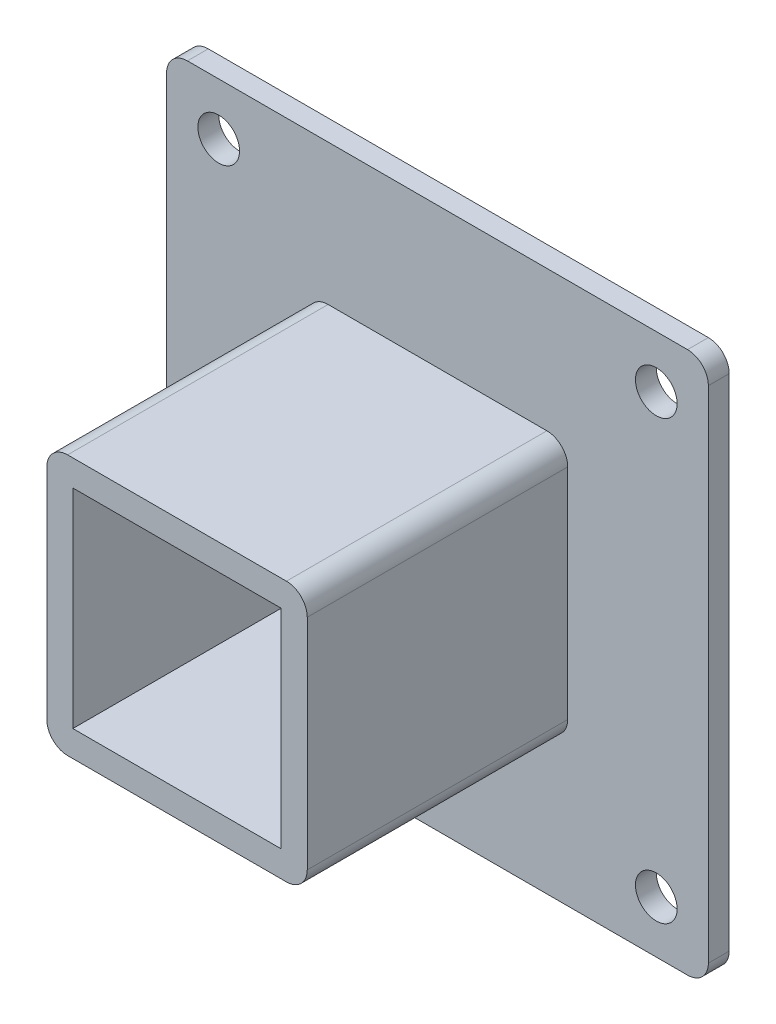
ISO-10303-21;
HEADER;
FILE_DESCRIPTION(('STEP AP214'),'2;1');
FILE_NAME('part.step','',(''),(''),'','','');
FILE_SCHEMA(('AUTOMOTIVE_DESIGN { 1 0 10303 214 1 1 1 1 }'));
ENDSEC;
DATA;
#1=APPLICATION_CONTEXT('core data for automotive mechanical design processes');
#2=APPLICATION_PROTOCOL_DEFINITION('international standard','automotive_design',2000,#1);
#3=PRODUCT_CONTEXT('',#1,'mechanical');
#4=PRODUCT('Part','Part','',(#3));
#5=PRODUCT_RELATED_PRODUCT_CATEGORY('part','',(#4));
#6=PRODUCT_DEFINITION_FORMATION('','',#4);
#7=PRODUCT_DEFINITION_CONTEXT('part definition',#1,'design');
#8=PRODUCT_DEFINITION('design','',#6,#7);
#9=PRODUCT_DEFINITION_SHAPE('','',#8);
#10=(LENGTH_UNIT() NAMED_UNIT(*) SI_UNIT(.MILLI.,.METRE.));
#11=(NAMED_UNIT(*) PLANE_ANGLE_UNIT() SI_UNIT($,.RADIAN.));
#12=(NAMED_UNIT(*) SI_UNIT($,.STERADIAN.) SOLID_ANGLE_UNIT());
#13=UNCERTAINTY_MEASURE_WITH_UNIT(LENGTH_MEASURE(1.E-05),#10,'distance_accuracy_value','');
#14=(GEOMETRIC_REPRESENTATION_CONTEXT(3) GLOBAL_UNCERTAINTY_ASSIGNED_CONTEXT((#13)) GLOBAL_UNIT_ASSIGNED_CONTEXT((#10,
#11,#12)) REPRESENTATION_CONTEXT('',''));
#15=CARTESIAN_POINT('',(0.,0.,0.));
#16=DIRECTION('',(0.,0.,1.));
#17=DIRECTION('',(1.,0.,0.));
#18=AXIS2_PLACEMENT_3D('',#15,#16,#17);
#19=CARTESIAN_POINT('',(10.5,-10.5,25.));
#20=DIRECTION('',(0.,0.,-1.));
#21=DIRECTION('',(-1.,0.,0.));
#22=AXIS2_PLACEMENT_3D('',#19,#20,#21);
#23=CYLINDRICAL_SURFACE('',#22,2.);
#24=DIRECTION('',(0.,0.,-1.));
#25=VECTOR('',#24,1.);
#26=CARTESIAN_POINT('',(12.5,-10.5,25.));
#27=LINE('',#26,#25);
#28=CARTESIAN_POINT('',(12.5,-10.5,25.));
#29=VERTEX_POINT('',#28);
#30=CARTESIAN_POINT('',(12.5,-10.5,0.));
#31=VERTEX_POINT('',#30);
#32=EDGE_CURVE('E327',#29,#31,#27,.T.);
#33=ORIENTED_EDGE('',*,*,#32,.F.);
#34=CARTESIAN_POINT('',(10.5,-10.5,25.));
#35=DIRECTION('',(0.,0.,1.));
#36=DIRECTION('',(1.,0.,0.));
#37=AXIS2_PLACEMENT_3D('',#34,#35,#36);
#38=CIRCLE('',#37,2.);
#39=CARTESIAN_POINT('',(10.5,-12.5,25.));
#40=VERTEX_POINT('',#39);
#41=EDGE_CURVE('E47',#40,#29,#38,.T.);
#42=ORIENTED_EDGE('',*,*,#41,.F.);
#43=DIRECTION('',(0.,0.,-1.));
#44=VECTOR('',#43,1.);
#45=CARTESIAN_POINT('',(10.5,-12.5,25.));
#46=LINE('',#45,#44);
#47=CARTESIAN_POINT('',(10.5,-12.5,0.));
#48=VERTEX_POINT('',#47);
#49=EDGE_CURVE('E330',#48,#40,#46,.F.);
#50=ORIENTED_EDGE('',*,*,#49,.F.);
#51=CARTESIAN_POINT('',(10.5,-10.5,0.));
#52=DIRECTION('',(0.,0.,-1.));
#53=DIRECTION('',(-1.,0.,0.));
#54=AXIS2_PLACEMENT_3D('',#51,#52,#53);
#55=CIRCLE('',#54,2.);
#56=EDGE_CURVE('E11',#48,#31,#55,.F.);
#57=ORIENTED_EDGE('',*,*,#56,.T.);
#58=EDGE_LOOP('',(#33,#42,#50,#57));
#59=FACE_BOUND('',#58,.T.);
#60=ADVANCED_FACE('F39',(#59),#23,.T.);
#61=CARTESIAN_POINT('',(10.5,10.5,25.));
#62=DIRECTION('',(0.,0.,-1.));
#63=DIRECTION('',(-1.,0.,0.));
#64=AXIS2_PLACEMENT_3D('',#61,#62,#63);
#65=CYLINDRICAL_SURFACE('',#64,2.);
#66=DIRECTION('',(0.,0.,-1.));
#67=VECTOR('',#66,1.);
#68=CARTESIAN_POINT('',(10.5,12.5,25.));
#69=LINE('',#68,#67);
#70=CARTESIAN_POINT('',(10.5,12.5,25.));
#71=VERTEX_POINT('',#70);
#72=CARTESIAN_POINT('',(10.5,12.5,0.));
#73=VERTEX_POINT('',#72);
#74=EDGE_CURVE('E317',#71,#73,#69,.T.);
#75=ORIENTED_EDGE('',*,*,#74,.F.);
#76=CARTESIAN_POINT('',(10.5,10.5,25.));
#77=DIRECTION('',(0.,0.,1.));
#78=DIRECTION('',(1.,0.,0.));
#79=AXIS2_PLACEMENT_3D('',#76,#77,#78);
#80=CIRCLE('',#79,2.);
#81=CARTESIAN_POINT('',(12.5,10.5,25.));
#82=VERTEX_POINT('',#81);
#83=EDGE_CURVE('E323',#82,#71,#80,.T.);
#84=ORIENTED_EDGE('',*,*,#83,.F.);
#85=DIRECTION('',(0.,0.,-1.));
#86=VECTOR('',#85,1.);
#87=CARTESIAN_POINT('',(12.5,10.5,25.));
#88=LINE('',#87,#86);
#89=CARTESIAN_POINT('',(12.5,10.5,0.));
#90=VERTEX_POINT('',#89);
#91=EDGE_CURVE('E320',#90,#82,#88,.F.);
#92=ORIENTED_EDGE('',*,*,#91,.F.);
#93=CARTESIAN_POINT('',(10.5,10.5,0.));
#94=DIRECTION('',(0.,0.,-1.));
#95=DIRECTION('',(-1.,0.,0.));
#96=AXIS2_PLACEMENT_3D('',#93,#94,#95);
#97=CIRCLE('',#96,2.);
#98=EDGE_CURVE('E325',#90,#73,#97,.F.);
#99=ORIENTED_EDGE('',*,*,#98,.T.);
#100=EDGE_LOOP('',(#75,#84,#92,#99));
#101=FACE_BOUND('',#100,.T.);
#102=ADVANCED_FACE('F425',(#101),#65,.T.);
#103=CARTESIAN_POINT('',(-10.5,10.5,25.));
#104=DIRECTION('',(0.,0.,-1.));
#105=DIRECTION('',(-1.,0.,0.));
#106=AXIS2_PLACEMENT_3D('',#103,#104,#105);
#107=CYLINDRICAL_SURFACE('',#106,2.);
#108=DIRECTION('',(0.,0.,-1.));
#109=VECTOR('',#108,1.);
#110=CARTESIAN_POINT('',(-12.5,10.5,25.));
#111=LINE('',#110,#109);
#112=CARTESIAN_POINT('',(-12.5,10.5,25.));
#113=VERTEX_POINT('',#112);
#114=CARTESIAN_POINT('',(-12.5,10.5,0.));
#115=VERTEX_POINT('',#114);
#116=EDGE_CURVE('E307',#113,#115,#111,.T.);
#117=ORIENTED_EDGE('',*,*,#116,.F.);
#118=CARTESIAN_POINT('',(-10.5,10.5,25.));
#119=DIRECTION('',(0.,0.,1.));
#120=DIRECTION('',(1.,0.,0.));
#121=AXIS2_PLACEMENT_3D('',#118,#119,#120);
#122=CIRCLE('',#121,2.);
#123=CARTESIAN_POINT('',(-10.5,12.5,25.));
#124=VERTEX_POINT('',#123);
#125=EDGE_CURVE('E313',#124,#113,#122,.T.);
#126=ORIENTED_EDGE('',*,*,#125,.F.);
#127=DIRECTION('',(0.,0.,-1.));
#128=VECTOR('',#127,1.);
#129=CARTESIAN_POINT('',(-10.5,12.5,25.));
#130=LINE('',#129,#128);
#131=CARTESIAN_POINT('',(-10.5,12.5,0.));
#132=VERTEX_POINT('',#131);
#133=EDGE_CURVE('E310',#132,#124,#130,.F.);
#134=ORIENTED_EDGE('',*,*,#133,.F.);
#135=CARTESIAN_POINT('',(-10.5,10.5,0.));
#136=DIRECTION('',(0.,0.,-1.));
#137=DIRECTION('',(-1.,0.,0.));
#138=AXIS2_PLACEMENT_3D('',#135,#136,#137);
#139=CIRCLE('',#138,2.);
#140=EDGE_CURVE('E315',#132,#115,#139,.F.);
#141=ORIENTED_EDGE('',*,*,#140,.T.);
#142=EDGE_LOOP('',(#117,#126,#134,#141));
#143=FACE_BOUND('',#142,.T.);
#144=ADVANCED_FACE('F429',(#143),#107,.T.);
#145=CARTESIAN_POINT('',(-10.5,-10.5,25.));
#146=DIRECTION('',(0.,0.,1.));
#147=DIRECTION('',(1.,0.,0.));
#148=AXIS2_PLACEMENT_3D('',#145,#146,#147);
#149=CYLINDRICAL_SURFACE('',#148,2.);
#150=DIRECTION('',(0.,0.,1.));
#151=VECTOR('',#150,1.);
#152=CARTESIAN_POINT('',(-12.5,-10.5,25.));
#153=LINE('',#152,#151);
#154=CARTESIAN_POINT('',(-12.5,-10.5,0.));
#155=VERTEX_POINT('',#154);
#156=CARTESIAN_POINT('',(-12.5,-10.5,25.));
#157=VERTEX_POINT('',#156);
#158=EDGE_CURVE('E297',#155,#157,#153,.T.);
#159=ORIENTED_EDGE('',*,*,#158,.F.);
#160=CARTESIAN_POINT('',(-10.5,-10.5,0.));
#161=DIRECTION('',(0.,0.,-1.));
#162=DIRECTION('',(-1.,0.,0.));
#163=AXIS2_PLACEMENT_3D('',#160,#161,#162);
#164=CIRCLE('',#163,2.);
#165=CARTESIAN_POINT('',(-10.5,-12.5,0.));
#166=VERTEX_POINT('',#165);
#167=EDGE_CURVE('E305',#155,#166,#164,.F.);
#168=ORIENTED_EDGE('',*,*,#167,.T.);
#169=DIRECTION('',(0.,0.,1.));
#170=VECTOR('',#169,1.);
#171=CARTESIAN_POINT('',(-10.5,-12.5,25.));
#172=LINE('',#171,#170);
#173=CARTESIAN_POINT('',(-10.5,-12.5,25.));
#174=VERTEX_POINT('',#173);
#175=EDGE_CURVE('E300',#174,#166,#172,.F.);
#176=ORIENTED_EDGE('',*,*,#175,.F.);
#177=CARTESIAN_POINT('',(-10.5,-10.5,25.));
#178=DIRECTION('',(0.,0.,1.));
#179=DIRECTION('',(1.,0.,0.));
#180=AXIS2_PLACEMENT_3D('',#177,#178,#179);
#181=CIRCLE('',#180,2.);
#182=EDGE_CURVE('E303',#157,#174,#181,.T.);
#183=ORIENTED_EDGE('',*,*,#182,.F.);
#184=EDGE_LOOP('',(#159,#168,#176,#183));
#185=FACE_BOUND('',#184,.T.);
#186=ADVANCED_FACE('F422',(#185),#149,.T.);
#187=CARTESIAN_POINT('',(24.,24.,-2.));
#188=DIRECTION('',(0.,0.,1.));
#189=DIRECTION('',(1.,0.,0.));
#190=AXIS2_PLACEMENT_3D('',#187,#188,#189);
#191=CYLINDRICAL_SURFACE('',#190,2.);
#192=DIRECTION('',(0.,0.,1.));
#193=VECTOR('',#192,1.);
#194=CARTESIAN_POINT('',(26.,24.,-2.));
#195=LINE('',#194,#193);
#196=CARTESIAN_POINT('',(26.,24.,-2.));
#197=VERTEX_POINT('',#196);
#198=CARTESIAN_POINT('',(26.,24.,0.));
#199=VERTEX_POINT('',#198);
#200=EDGE_CURVE('E287',#197,#199,#195,.T.);
#201=ORIENTED_EDGE('',*,*,#200,.F.);
#202=CARTESIAN_POINT('',(24.,24.,-2.));
#203=DIRECTION('',(0.,0.,-1.));
#204=DIRECTION('',(-1.,0.,0.));
#205=AXIS2_PLACEMENT_3D('',#202,#203,#204);
#206=CIRCLE('',#205,2.);
#207=CARTESIAN_POINT('',(24.,26.,-2.));
#208=VERTEX_POINT('',#207);
#209=EDGE_CURVE('E293',#208,#197,#206,.T.);
#210=ORIENTED_EDGE('',*,*,#209,.F.);
#211=DIRECTION('',(0.,0.,1.));
#212=VECTOR('',#211,1.);
#213=CARTESIAN_POINT('',(24.,26.,-2.));
#214=LINE('',#213,#212);
#215=CARTESIAN_POINT('',(24.,26.,0.));
#216=VERTEX_POINT('',#215);
#217=EDGE_CURVE('E290',#216,#208,#214,.F.);
#218=ORIENTED_EDGE('',*,*,#217,.F.);
#219=CARTESIAN_POINT('',(24.,24.,0.));
#220=DIRECTION('',(0.,0.,-1.));
#221=DIRECTION('',(-1.,0.,0.));
#222=AXIS2_PLACEMENT_3D('',#219,#220,#221);
#223=CIRCLE('',#222,2.);
#224=EDGE_CURVE('E295',#199,#216,#223,.F.);
#225=ORIENTED_EDGE('',*,*,#224,.F.);
#226=EDGE_LOOP('',(#201,#210,#218,#225));
#227=FACE_BOUND('',#226,.T.);
#228=ADVANCED_FACE('F391',(#227),#191,.T.);
#229=CARTESIAN_POINT('',(24.,-24.,-2.));
#230=DIRECTION('',(0.,0.,1.));
#231=DIRECTION('',(1.,0.,0.));
#232=AXIS2_PLACEMENT_3D('',#229,#230,#231);
#233=CYLINDRICAL_SURFACE('',#232,2.);
#234=DIRECTION('',(0.,0.,1.));
#235=VECTOR('',#234,1.);
#236=CARTESIAN_POINT('',(24.,-26.,-2.));
#237=LINE('',#236,#235);
#238=CARTESIAN_POINT('',(24.,-26.,-2.));
#239=VERTEX_POINT('',#238);
#240=CARTESIAN_POINT('',(24.,-26.,0.));
#241=VERTEX_POINT('',#240);
#242=EDGE_CURVE('E276',#239,#241,#237,.T.);
#243=ORIENTED_EDGE('',*,*,#242,.F.);
#244=CARTESIAN_POINT('',(24.,-24.,-2.));
#245=DIRECTION('',(0.,0.,-1.));
#246=DIRECTION('',(-1.,0.,0.));
#247=AXIS2_PLACEMENT_3D('',#244,#245,#246);
#248=CIRCLE('',#247,2.);
#249=CARTESIAN_POINT('',(26.,-24.,-2.));
#250=VERTEX_POINT('',#249);
#251=EDGE_CURVE('E282',#250,#239,#248,.T.);
#252=ORIENTED_EDGE('',*,*,#251,.F.);
#253=DIRECTION('',(0.,0.,1.));
#254=VECTOR('',#253,1.);
#255=CARTESIAN_POINT('',(26.,-24.,-2.));
#256=LINE('',#255,#254);
#257=CARTESIAN_POINT('',(26.,-24.,0.));
#258=VERTEX_POINT('',#257);
#259=EDGE_CURVE('E279',#258,#250,#256,.F.);
#260=ORIENTED_EDGE('',*,*,#259,.F.);
#261=CARTESIAN_POINT('',(24.,-24.,0.));
#262=DIRECTION('',(0.,0.,-1.));
#263=DIRECTION('',(-1.,0.,0.));
#264=AXIS2_PLACEMENT_3D('',#261,#262,#263);
#265=CIRCLE('',#264,2.);
#266=EDGE_CURVE('E284',#241,#258,#265,.F.);
#267=ORIENTED_EDGE('',*,*,#266,.F.);
#268=EDGE_LOOP('',(#243,#252,#260,#267));
#269=FACE_BOUND('',#268,.T.);
#270=ADVANCED_FACE('F414',(#269),#233,.T.);
#271=CARTESIAN_POINT('',(-24.,-24.,-2.));
#272=DIRECTION('',(0.,0.,1.));
#273=DIRECTION('',(1.,0.,0.));
#274=AXIS2_PLACEMENT_3D('',#271,#272,#273);
#275=CYLINDRICAL_SURFACE('',#274,2.);
#276=DIRECTION('',(0.,0.,1.));
#277=VECTOR('',#276,1.);
#278=CARTESIAN_POINT('',(-26.,-24.,-2.));
#279=LINE('',#278,#277);
#280=CARTESIAN_POINT('',(-26.,-24.,-2.));
#281=VERTEX_POINT('',#280);
#282=CARTESIAN_POINT('',(-26.,-24.,0.));
#283=VERTEX_POINT('',#282);
#284=EDGE_CURVE('E265',#281,#283,#279,.T.);
#285=ORIENTED_EDGE('',*,*,#284,.F.);
#286=CARTESIAN_POINT('',(-24.,-24.,-2.));
#287=DIRECTION('',(0.,0.,-1.));
#288=DIRECTION('',(-1.,0.,0.));
#289=AXIS2_PLACEMENT_3D('',#286,#287,#288);
#290=CIRCLE('',#289,2.);
#291=CARTESIAN_POINT('',(-24.,-26.,-2.));
#292=VERTEX_POINT('',#291);
#293=EDGE_CURVE('E271',#292,#281,#290,.T.);
#294=ORIENTED_EDGE('',*,*,#293,.F.);
#295=DIRECTION('',(0.,0.,1.));
#296=VECTOR('',#295,1.);
#297=CARTESIAN_POINT('',(-24.,-26.,-2.));
#298=LINE('',#297,#296);
#299=CARTESIAN_POINT('',(-24.,-26.,0.));
#300=VERTEX_POINT('',#299);
#301=EDGE_CURVE('E268',#300,#292,#298,.F.);
#302=ORIENTED_EDGE('',*,*,#301,.F.);
#303=CARTESIAN_POINT('',(-24.,-24.,0.));
#304=DIRECTION('',(0.,0.,-1.));
#305=DIRECTION('',(-1.,0.,0.));
#306=AXIS2_PLACEMENT_3D('',#303,#304,#305);
#307=CIRCLE('',#306,2.);
#308=EDGE_CURVE('E273',#283,#300,#307,.F.);
#309=ORIENTED_EDGE('',*,*,#308,.F.);
#310=EDGE_LOOP('',(#285,#294,#302,#309));
#311=FACE_BOUND('',#310,.T.);
#312=ADVANCED_FACE('F407',(#311),#275,.T.);
#313=CARTESIAN_POINT('',(-24.,24.,-2.));
#314=DIRECTION('',(0.,0.,1.));
#315=DIRECTION('',(1.,0.,0.));
#316=AXIS2_PLACEMENT_3D('',#313,#314,#315);
#317=CYLINDRICAL_SURFACE('',#316,2.);
#318=DIRECTION('',(0.,0.,1.));
#319=VECTOR('',#318,1.);
#320=CARTESIAN_POINT('',(-24.,26.,-2.));
#321=LINE('',#320,#319);
#322=CARTESIAN_POINT('',(-24.,26.,-2.));
#323=VERTEX_POINT('',#322);
#324=CARTESIAN_POINT('',(-24.,26.,0.));
#325=VERTEX_POINT('',#324);
#326=EDGE_CURVE('E247',#323,#325,#321,.T.);
#327=ORIENTED_EDGE('',*,*,#326,.F.);
#328=CARTESIAN_POINT('',(-24.,24.,-2.));
#329=DIRECTION('',(0.,0.,-1.));
#330=DIRECTION('',(-1.,0.,0.));
#331=AXIS2_PLACEMENT_3D('',#328,#329,#330);
#332=CIRCLE('',#331,2.);
#333=CARTESIAN_POINT('',(-26.,24.,-2.));
#334=VERTEX_POINT('',#333);
#335=EDGE_CURVE('E260',#334,#323,#332,.T.);
#336=ORIENTED_EDGE('',*,*,#335,.F.);
#337=DIRECTION('',(0.,0.,1.));
#338=VECTOR('',#337,1.);
#339=CARTESIAN_POINT('',(-26.,24.,-2.));
#340=LINE('',#339,#338);
#341=CARTESIAN_POINT('',(-26.,24.,0.));
#342=VERTEX_POINT('',#341);
#343=EDGE_CURVE('E257',#342,#334,#340,.F.);
#344=ORIENTED_EDGE('',*,*,#343,.F.);
#345=CARTESIAN_POINT('',(-24.,24.,0.));
#346=DIRECTION('',(0.,0.,-1.));
#347=DIRECTION('',(-1.,0.,0.));
#348=AXIS2_PLACEMENT_3D('',#345,#346,#347);
#349=CIRCLE('',#348,2.);
#350=EDGE_CURVE('E262',#325,#342,#349,.F.);
#351=ORIENTED_EDGE('',*,*,#350,.F.);
#352=EDGE_LOOP('',(#327,#336,#344,#351));
#353=FACE_BOUND('',#352,.T.);
#354=ADVANCED_FACE('F400',(#353),#317,.T.);
#355=CARTESIAN_POINT('',(0.,0.,25.));
#356=DIRECTION('',(0.,0.,1.));
#357=DIRECTION('',(1.,0.,0.));
#358=AXIS2_PLACEMENT_3D('',#355,#356,#357);
#359=PLANE('',#358);
#360=DIRECTION('',(1.,0.,0.));
#361=VECTOR('',#360,1.);
#362=CARTESIAN_POINT('',(-12.5,-12.5,25.));
#363=LINE('',#362,#361);
#364=EDGE_CURVE('E244',#174,#40,#363,.T.);
#365=ORIENTED_EDGE('',*,*,#364,.T.);
#366=ORIENTED_EDGE('',*,*,#41,.T.);
#367=DIRECTION('',(0.,1.,0.));
#368=VECTOR('',#367,1.);
#369=CARTESIAN_POINT('',(12.5,12.5,25.));
#370=LINE('',#369,#368);
#371=EDGE_CURVE('E237',#29,#82,#370,.T.);
#372=ORIENTED_EDGE('',*,*,#371,.T.);
#373=ORIENTED_EDGE('',*,*,#83,.T.);
#374=DIRECTION('',(-1.,0.,0.));
#375=VECTOR('',#374,1.);
#376=CARTESIAN_POINT('',(-12.5,12.5,25.));
#377=LINE('',#376,#375);
#378=EDGE_CURVE('E239',#71,#124,#377,.T.);
#379=ORIENTED_EDGE('',*,*,#378,.T.);
#380=ORIENTED_EDGE('',*,*,#125,.T.);
#381=DIRECTION('',(0.,-1.,0.));
#382=VECTOR('',#381,1.);
#383=CARTESIAN_POINT('',(-12.5,12.5,25.));
#384=LINE('',#383,#382);
#385=EDGE_CURVE('E242',#113,#157,#384,.T.);
#386=ORIENTED_EDGE('',*,*,#385,.T.);
#387=ORIENTED_EDGE('',*,*,#182,.T.);
#388=EDGE_LOOP('',(#365,#366,#372,#373,#379,#380,#386,#387));
#389=FACE_BOUND('',#388,.T.);
#390=DIRECTION('',(-1.,0.,0.));
#391=VECTOR('',#390,1.);
#392=CARTESIAN_POINT('',(-10.,10.,25.));
#393=LINE('',#392,#391);
#394=CARTESIAN_POINT('',(10.,10.,25.));
#395=VERTEX_POINT('',#394);
#396=CARTESIAN_POINT('',(-10.,10.,25.));
#397=VERTEX_POINT('',#396);
#398=EDGE_CURVE('E225',#395,#397,#393,.T.);
#399=ORIENTED_EDGE('',*,*,#398,.F.);
#400=DIRECTION('',(0.,1.,0.));
#401=VECTOR('',#400,1.);
#402=CARTESIAN_POINT('',(10.,10.,25.));
#403=LINE('',#402,#401);
#404=CARTESIAN_POINT('',(10.,-10.,25.));
#405=VERTEX_POINT('',#404);
#406=EDGE_CURVE('E183',#405,#395,#403,.T.);
#407=ORIENTED_EDGE('',*,*,#406,.F.);
#408=DIRECTION('',(1.,0.,0.));
#409=VECTOR('',#408,1.);
#410=CARTESIAN_POINT('',(-10.,-10.,25.));
#411=LINE('',#410,#409);
#412=CARTESIAN_POINT('',(-10.,-10.,25.));
#413=VERTEX_POINT('',#412);
#414=EDGE_CURVE('E230',#413,#405,#411,.T.);
#415=ORIENTED_EDGE('',*,*,#414,.F.);
#416=DIRECTION('',(0.,-1.,0.));
#417=VECTOR('',#416,1.);
#418=CARTESIAN_POINT('',(-10.,10.,25.));
#419=LINE('',#418,#417);
#420=EDGE_CURVE('E227',#397,#413,#419,.T.);
#421=ORIENTED_EDGE('',*,*,#420,.F.);
#422=EDGE_LOOP('',(#399,#407,#415,#421));
#423=FACE_BOUND('',#422,.T.);
#424=ADVANCED_FACE('F437',(#389,#423),#359,.T.);
#425=CARTESIAN_POINT('',(12.5,12.5,25.));
#426=DIRECTION('',(-1.,0.,0.));
#427=DIRECTION('',(0.,-1.,0.));
#428=AXIS2_PLACEMENT_3D('',#425,#426,#427);
#429=PLANE('',#428);
#430=ORIENTED_EDGE('',*,*,#371,.F.);
#431=ORIENTED_EDGE('',*,*,#32,.T.);
#432=DIRECTION('',(0.,1.,0.));
#433=VECTOR('',#432,1.);
#434=CARTESIAN_POINT('',(12.5,12.5,0.));
#435=LINE('',#434,#433);
#436=EDGE_CURVE('E186',#31,#90,#435,.T.);
#437=ORIENTED_EDGE('',*,*,#436,.T.);
#438=ORIENTED_EDGE('',*,*,#91,.T.);
#439=EDGE_LOOP('',(#430,#431,#437,#438));
#440=FACE_BOUND('',#439,.T.);
#441=ADVANCED_FACE('F433',(#440),#429,.F.);
#442=CARTESIAN_POINT('',(-12.5,12.5,25.));
#443=DIRECTION('',(0.,-1.,0.));
#444=DIRECTION('',(0.,0.,-1.));
#445=AXIS2_PLACEMENT_3D('',#442,#443,#444);
#446=PLANE('',#445);
#447=ORIENTED_EDGE('',*,*,#378,.F.);
#448=ORIENTED_EDGE('',*,*,#74,.T.);
#449=DIRECTION('',(-1.,0.,0.));
#450=VECTOR('',#449,1.);
#451=CARTESIAN_POINT('',(-12.5,12.5,0.));
#452=LINE('',#451,#450);
#453=EDGE_CURVE('E249',#73,#132,#452,.T.);
#454=ORIENTED_EDGE('',*,*,#453,.T.);
#455=ORIENTED_EDGE('',*,*,#133,.T.);
#456=EDGE_LOOP('',(#447,#448,#454,#455));
#457=FACE_BOUND('',#456,.T.);
#458=ADVANCED_FACE('F443',(#457),#446,.F.);
#459=CARTESIAN_POINT('',(-12.5,12.5,25.));
#460=DIRECTION('',(1.,0.,0.));
#461=DIRECTION('',(0.,1.,0.));
#462=AXIS2_PLACEMENT_3D('',#459,#460,#461);
#463=PLANE('',#462);
#464=ORIENTED_EDGE('',*,*,#385,.F.);
#465=ORIENTED_EDGE('',*,*,#116,.T.);
#466=DIRECTION('',(0.,-1.,0.));
#467=VECTOR('',#466,1.);
#468=CARTESIAN_POINT('',(-12.5,12.5,0.));
#469=LINE('',#468,#467);
#470=EDGE_CURVE('E251',#115,#155,#469,.T.);
#471=ORIENTED_EDGE('',*,*,#470,.T.);
#472=ORIENTED_EDGE('',*,*,#158,.T.);
#473=EDGE_LOOP('',(#464,#465,#471,#472));
#474=FACE_BOUND('',#473,.T.);
#475=ADVANCED_FACE('F452',(#474),#463,.F.);
#476=CARTESIAN_POINT('',(-12.5,-12.5,25.));
#477=DIRECTION('',(0.,1.,0.));
#478=DIRECTION('',(0.,0.,1.));
#479=AXIS2_PLACEMENT_3D('',#476,#477,#478);
#480=PLANE('',#479);
#481=DIRECTION('',(1.,0.,0.));
#482=VECTOR('',#481,1.);
#483=CARTESIAN_POINT('',(-12.5,-12.5,0.));
#484=LINE('',#483,#482);
#485=EDGE_CURVE('E240',#166,#48,#484,.T.);
#486=ORIENTED_EDGE('',*,*,#485,.T.);
#487=ORIENTED_EDGE('',*,*,#49,.T.);
#488=ORIENTED_EDGE('',*,*,#364,.F.);
#489=ORIENTED_EDGE('',*,*,#175,.T.);
#490=EDGE_LOOP('',(#486,#487,#488,#489));
#491=FACE_BOUND('',#490,.T.);
#492=ADVANCED_FACE('F460',(#491),#480,.F.);
#493=CARTESIAN_POINT('',(10.,10.,25.));
#494=DIRECTION('',(-1.,0.,0.));
#495=DIRECTION('',(0.,-1.,0.));
#496=AXIS2_PLACEMENT_3D('',#493,#494,#495);
#497=PLANE('',#496);
#498=DIRECTION('',(0.,0.,-1.));
#499=VECTOR('',#498,1.);
#500=CARTESIAN_POINT('',(10.,10.,25.));
#501=LINE('',#500,#499);
#502=CARTESIAN_POINT('',(10.,10.,-2.));
#503=VERTEX_POINT('',#502);
#504=EDGE_CURVE('E175',#395,#503,#501,.T.);
#505=ORIENTED_EDGE('',*,*,#504,.T.);
#506=DIRECTION('',(0.,-1.,0.));
#507=VECTOR('',#506,1.);
#508=CARTESIAN_POINT('',(10.,10.,-2.));
#509=LINE('',#508,#507);
#510=CARTESIAN_POINT('',(10.,-10.,-2.));
#511=VERTEX_POINT('',#510);
#512=EDGE_CURVE('E180',#503,#511,#509,.T.);
#513=ORIENTED_EDGE('',*,*,#512,.T.);
#514=DIRECTION('',(0.,0.,-1.));
#515=VECTOR('',#514,1.);
#516=CARTESIAN_POINT('',(10.,-10.,25.));
#517=LINE('',#516,#515);
#518=EDGE_CURVE('E232',#405,#511,#517,.T.);
#519=ORIENTED_EDGE('',*,*,#518,.F.);
#520=ORIENTED_EDGE('',*,*,#406,.T.);
#521=EDGE_LOOP('',(#505,#513,#519,#520));
#522=FACE_BOUND('',#521,.T.);
#523=ADVANCED_FACE('F177',(#522),#497,.T.);
#524=CARTESIAN_POINT('',(-10.,10.,25.));
#525=DIRECTION('',(0.,-1.,0.));
#526=DIRECTION('',(0.,0.,-1.));
#527=AXIS2_PLACEMENT_3D('',#524,#525,#526);
#528=PLANE('',#527);
#529=DIRECTION('',(0.,0.,-1.));
#530=VECTOR('',#529,1.);
#531=CARTESIAN_POINT('',(-10.,10.,25.));
#532=LINE('',#531,#530);
#533=CARTESIAN_POINT('',(-10.,10.,-2.));
#534=VERTEX_POINT('',#533);
#535=EDGE_CURVE('E187',#397,#534,#532,.T.);
#536=ORIENTED_EDGE('',*,*,#535,.T.);
#537=DIRECTION('',(1.,0.,0.));
#538=VECTOR('',#537,1.);
#539=CARTESIAN_POINT('',(10.,10.,-2.));
#540=LINE('',#539,#538);
#541=EDGE_CURVE('E190',#534,#503,#540,.T.);
#542=ORIENTED_EDGE('',*,*,#541,.T.);
#543=ORIENTED_EDGE('',*,*,#504,.F.);
#544=ORIENTED_EDGE('',*,*,#398,.T.);
#545=EDGE_LOOP('',(#536,#542,#543,#544));
#546=FACE_BOUND('',#545,.T.);
#547=ADVANCED_FACE('F191',(#546),#528,.T.);
#548=CARTESIAN_POINT('',(-10.,10.,25.));
#549=DIRECTION('',(1.,0.,0.));
#550=DIRECTION('',(0.,1.,0.));
#551=AXIS2_PLACEMENT_3D('',#548,#549,#550);
#552=PLANE('',#551);
#553=DIRECTION('',(0.,0.,-1.));
#554=VECTOR('',#553,1.);
#555=CARTESIAN_POINT('',(-10.,-10.,25.));
#556=LINE('',#555,#554);
#557=CARTESIAN_POINT('',(-10.,-10.,-2.));
#558=VERTEX_POINT('',#557);
#559=EDGE_CURVE('E234',#413,#558,#556,.T.);
#560=ORIENTED_EDGE('',*,*,#559,.T.);
#561=DIRECTION('',(0.,1.,0.));
#562=VECTOR('',#561,1.);
#563=CARTESIAN_POINT('',(-10.,10.,-2.));
#564=LINE('',#563,#562);
#565=EDGE_CURVE('E196',#558,#534,#564,.T.);
#566=ORIENTED_EDGE('',*,*,#565,.T.);
#567=ORIENTED_EDGE('',*,*,#535,.F.);
#568=ORIENTED_EDGE('',*,*,#420,.T.);
#569=EDGE_LOOP('',(#560,#566,#567,#568));
#570=FACE_BOUND('',#569,.T.);
#571=ADVANCED_FACE('F661',(#570),#552,.T.);
#572=CARTESIAN_POINT('',(-10.,-10.,25.));
#573=DIRECTION('',(0.,1.,0.));
#574=DIRECTION('',(0.,0.,1.));
#575=AXIS2_PLACEMENT_3D('',#572,#573,#574);
#576=PLANE('',#575);
#577=ORIENTED_EDGE('',*,*,#518,.T.);
#578=DIRECTION('',(-1.,0.,0.));
#579=VECTOR('',#578,1.);
#580=CARTESIAN_POINT('',(10.,-10.,-2.));
#581=LINE('',#580,#579);
#582=EDGE_CURVE('E201',#511,#558,#581,.T.);
#583=ORIENTED_EDGE('',*,*,#582,.T.);
#584=ORIENTED_EDGE('',*,*,#559,.F.);
#585=ORIENTED_EDGE('',*,*,#414,.T.);
#586=EDGE_LOOP('',(#577,#583,#584,#585));
#587=FACE_BOUND('',#586,.T.);
#588=ADVANCED_FACE('F652',(#587),#576,.T.);
#589=CARTESIAN_POINT('',(-26.,26.,-2.));
#590=DIRECTION('',(1.,0.,0.));
#591=DIRECTION('',(0.,1.,0.));
#592=AXIS2_PLACEMENT_3D('',#589,#590,#591);
#593=PLANE('',#592);
#594=DIRECTION('',(0.,1.,0.));
#595=VECTOR('',#594,1.);
#596=CARTESIAN_POINT('',(-26.,26.,-2.));
#597=LINE('',#596,#595);
#598=EDGE_CURVE('E207',#281,#334,#597,.T.);
#599=ORIENTED_EDGE('',*,*,#598,.F.);
#600=ORIENTED_EDGE('',*,*,#284,.T.);
#601=DIRECTION('',(0.,1.,0.));
#602=VECTOR('',#601,1.);
#603=CARTESIAN_POINT('',(-26.,26.,0.));
#604=LINE('',#603,#602);
#605=EDGE_CURVE('E203',#283,#342,#604,.T.);
#606=ORIENTED_EDGE('',*,*,#605,.T.);
#607=ORIENTED_EDGE('',*,*,#343,.T.);
#608=EDGE_LOOP('',(#599,#600,#606,#607));
#609=FACE_BOUND('',#608,.T.);
#610=ADVANCED_FACE('F403',(#609),#593,.F.);
#611=CARTESIAN_POINT('',(26.,26.,-2.));
#612=DIRECTION('',(0.,-1.,0.));
#613=DIRECTION('',(0.,0.,-1.));
#614=AXIS2_PLACEMENT_3D('',#611,#612,#613);
#615=PLANE('',#614);
#616=DIRECTION('',(1.,0.,0.));
#617=VECTOR('',#616,1.);
#618=CARTESIAN_POINT('',(26.,26.,0.));
#619=LINE('',#618,#617);
#620=EDGE_CURVE('E218',#325,#216,#619,.T.);
#621=ORIENTED_EDGE('',*,*,#620,.T.);
#622=ORIENTED_EDGE('',*,*,#217,.T.);
#623=DIRECTION('',(1.,0.,0.));
#624=VECTOR('',#623,1.);
#625=CARTESIAN_POINT('',(26.,26.,-2.));
#626=LINE('',#625,#624);
#627=EDGE_CURVE('E209',#323,#208,#626,.T.);
#628=ORIENTED_EDGE('',*,*,#627,.F.);
#629=ORIENTED_EDGE('',*,*,#326,.T.);
#630=EDGE_LOOP('',(#621,#622,#628,#629));
#631=FACE_BOUND('',#630,.T.);
#632=ADVANCED_FACE('F394',(#631),#615,.F.);
#633=CARTESIAN_POINT('',(26.,26.,-2.));
#634=DIRECTION('',(-1.,0.,0.));
#635=DIRECTION('',(0.,-1.,0.));
#636=AXIS2_PLACEMENT_3D('',#633,#634,#635);
#637=PLANE('',#636);
#638=DIRECTION('',(0.,-1.,0.));
#639=VECTOR('',#638,1.);
#640=CARTESIAN_POINT('',(26.,26.,-2.));
#641=LINE('',#640,#639);
#642=EDGE_CURVE('E213',#197,#250,#641,.T.);
#643=ORIENTED_EDGE('',*,*,#642,.F.);
#644=ORIENTED_EDGE('',*,*,#200,.T.);
#645=DIRECTION('',(0.,-1.,0.));
#646=VECTOR('',#645,1.);
#647=CARTESIAN_POINT('',(26.,26.,0.));
#648=LINE('',#647,#646);
#649=EDGE_CURVE('E221',#199,#258,#648,.T.);
#650=ORIENTED_EDGE('',*,*,#649,.T.);
#651=ORIENTED_EDGE('',*,*,#259,.T.);
#652=EDGE_LOOP('',(#643,#644,#650,#651));
#653=FACE_BOUND('',#652,.T.);
#654=ADVANCED_FACE('F388',(#653),#637,.F.);
#655=CARTESIAN_POINT('',(26.,-26.,-2.));
#656=DIRECTION('',(0.,1.,0.));
#657=DIRECTION('',(0.,0.,1.));
#658=AXIS2_PLACEMENT_3D('',#655,#656,#657);
#659=PLANE('',#658);
#660=DIRECTION('',(-1.,0.,0.));
#661=VECTOR('',#660,1.);
#662=CARTESIAN_POINT('',(26.,-26.,-2.));
#663=LINE('',#662,#661);
#664=EDGE_CURVE('E215',#239,#292,#663,.T.);
#665=ORIENTED_EDGE('',*,*,#664,.F.);
#666=ORIENTED_EDGE('',*,*,#242,.T.);
#667=DIRECTION('',(-1.,0.,0.));
#668=VECTOR('',#667,1.);
#669=CARTESIAN_POINT('',(26.,-26.,0.));
#670=LINE('',#669,#668);
#671=EDGE_CURVE('E210',#241,#300,#670,.T.);
#672=ORIENTED_EDGE('',*,*,#671,.T.);
#673=ORIENTED_EDGE('',*,*,#301,.T.);
#674=EDGE_LOOP('',(#665,#666,#672,#673));
#675=FACE_BOUND('',#674,.T.);
#676=ADVANCED_FACE('F366',(#675),#659,.F.);
#677=CARTESIAN_POINT('',(0.,0.,-2.));
#678=DIRECTION('',(0.,0.,-1.));
#679=DIRECTION('',(-1.,0.,0.));
#680=AXIS2_PLACEMENT_3D('',#677,#678,#679);
#681=PLANE('',#680);
#682=CARTESIAN_POINT('',(-21.,21.,-2.));
#683=DIRECTION('',(0.,0.,-1.));
#684=DIRECTION('',(-1.,0.,0.));
#685=AXIS2_PLACEMENT_3D('',#682,#683,#684);
#686=CIRCLE('',#685,2.);
#687=CARTESIAN_POINT('',(-23.,21.,-2.));
#688=VERTEX_POINT('',#687);
#689=EDGE_CURVE('E350',#688,#688,#686,.T.);
#690=ORIENTED_EDGE('',*,*,#689,.F.);
#691=EDGE_LOOP('',(#690));
#692=FACE_BOUND('',#691,.T.);
#693=CARTESIAN_POINT('',(20.9999999999999,-21.,-2.));
#694=DIRECTION('',(0.,0.,-1.));
#695=DIRECTION('',(-1.,0.,0.));
#696=AXIS2_PLACEMENT_3D('',#693,#694,#695);
#697=CIRCLE('',#696,1.99999999999999);
#698=CARTESIAN_POINT('',(18.9999999999999,-21.,-2.));
#699=VERTEX_POINT('',#698);
#700=EDGE_CURVE('E351',#699,#699,#697,.T.);
#701=ORIENTED_EDGE('',*,*,#700,.F.);
#702=EDGE_LOOP('',(#701));
#703=FACE_BOUND('',#702,.T.);
#704=CARTESIAN_POINT('',(-21.,-21.,-2.));
#705=DIRECTION('',(0.,0.,-1.));
#706=DIRECTION('',(-1.,0.,0.));
#707=AXIS2_PLACEMENT_3D('',#704,#705,#706);
#708=CIRCLE('',#707,2.);
#709=CARTESIAN_POINT('',(-23.,-21.,-2.));
#710=VERTEX_POINT('',#709);
#711=EDGE_CURVE('E354',#710,#710,#708,.T.);
#712=ORIENTED_EDGE('',*,*,#711,.F.);
#713=EDGE_LOOP('',(#712));
#714=FACE_BOUND('',#713,.T.);
#715=CARTESIAN_POINT('',(21.,21.,-2.));
#716=DIRECTION('',(0.,0.,-1.));
#717=DIRECTION('',(-1.,0.,0.));
#718=AXIS2_PLACEMENT_3D('',#715,#716,#717);
#719=CIRCLE('',#718,2.);
#720=CARTESIAN_POINT('',(19.,21.,-2.));
#721=VERTEX_POINT('',#720);
#722=EDGE_CURVE('E337',#721,#721,#719,.T.);
#723=ORIENTED_EDGE('',*,*,#722,.F.);
#724=EDGE_LOOP('',(#723));
#725=FACE_BOUND('',#724,.T.);
#726=ORIENTED_EDGE('',*,*,#565,.F.);
#727=ORIENTED_EDGE('',*,*,#582,.F.);
#728=ORIENTED_EDGE('',*,*,#512,.F.);
#729=ORIENTED_EDGE('',*,*,#541,.F.);
#730=EDGE_LOOP('',(#726,#727,#728,#729));
#731=FACE_BOUND('',#730,.T.);
#732=ORIENTED_EDGE('',*,*,#627,.T.);
#733=ORIENTED_EDGE('',*,*,#209,.T.);
#734=ORIENTED_EDGE('',*,*,#642,.T.);
#735=ORIENTED_EDGE('',*,*,#251,.T.);
#736=ORIENTED_EDGE('',*,*,#664,.T.);
#737=ORIENTED_EDGE('',*,*,#293,.T.);
#738=ORIENTED_EDGE('',*,*,#598,.T.);
#739=ORIENTED_EDGE('',*,*,#335,.T.);
#740=EDGE_LOOP('',(#732,#733,#734,#735,#736,#737,#738,#739));
#741=FACE_BOUND('',#740,.T.);
#742=ADVANCED_FACE('F198',(#692,#703,#714,#725,#731,#741),#681,.T.);
#743=CARTESIAN_POINT('',(0.,0.,0.));
#744=DIRECTION('',(0.,0.,-1.));
#745=DIRECTION('',(-1.,0.,0.));
#746=AXIS2_PLACEMENT_3D('',#743,#744,#745);
#747=PLANE('',#746);
#748=CARTESIAN_POINT('',(-21.,21.,0.));
#749=DIRECTION('',(0.,0.,-1.));
#750=DIRECTION('',(-1.,0.,0.));
#751=AXIS2_PLACEMENT_3D('',#748,#749,#750);
#752=CIRCLE('',#751,2.);
#753=CARTESIAN_POINT('',(-23.,21.,0.));
#754=VERTEX_POINT('',#753);
#755=EDGE_CURVE('E42',#754,#754,#752,.T.);
#756=ORIENTED_EDGE('',*,*,#755,.T.);
#757=EDGE_LOOP('',(#756));
#758=FACE_BOUND('',#757,.T.);
#759=CARTESIAN_POINT('',(20.9999999999999,-21.,0.));
#760=DIRECTION('',(0.,0.,-1.));
#761=DIRECTION('',(-1.,0.,0.));
#762=AXIS2_PLACEMENT_3D('',#759,#760,#761);
#763=CIRCLE('',#762,1.99999999999999);
#764=CARTESIAN_POINT('',(18.9999999999999,-21.,0.));
#765=VERTEX_POINT('',#764);
#766=EDGE_CURVE('E339',#765,#765,#763,.T.);
#767=ORIENTED_EDGE('',*,*,#766,.T.);
#768=EDGE_LOOP('',(#767));
#769=FACE_BOUND('',#768,.T.);
#770=CARTESIAN_POINT('',(-21.,-21.,0.));
#771=DIRECTION('',(0.,0.,-1.));
#772=DIRECTION('',(-1.,0.,0.));
#773=AXIS2_PLACEMENT_3D('',#770,#771,#772);
#774=CIRCLE('',#773,2.);
#775=CARTESIAN_POINT('',(-23.,-21.,0.));
#776=VERTEX_POINT('',#775);
#777=EDGE_CURVE('E336',#776,#776,#774,.T.);
#778=ORIENTED_EDGE('',*,*,#777,.T.);
#779=EDGE_LOOP('',(#778));
#780=FACE_BOUND('',#779,.T.);
#781=CARTESIAN_POINT('',(21.,21.,0.));
#782=DIRECTION('',(0.,0.,-1.));
#783=DIRECTION('',(-1.,0.,0.));
#784=AXIS2_PLACEMENT_3D('',#781,#782,#783);
#785=CIRCLE('',#784,2.);
#786=CARTESIAN_POINT('',(19.,21.,0.));
#787=VERTEX_POINT('',#786);
#788=EDGE_CURVE('E333',#787,#787,#785,.T.);
#789=ORIENTED_EDGE('',*,*,#788,.T.);
#790=EDGE_LOOP('',(#789));
#791=FACE_BOUND('',#790,.T.);
#792=ORIENTED_EDGE('',*,*,#436,.F.);
#793=ORIENTED_EDGE('',*,*,#56,.F.);
#794=ORIENTED_EDGE('',*,*,#485,.F.);
#795=ORIENTED_EDGE('',*,*,#167,.F.);
#796=ORIENTED_EDGE('',*,*,#470,.F.);
#797=ORIENTED_EDGE('',*,*,#140,.F.);
#798=ORIENTED_EDGE('',*,*,#453,.F.);
#799=ORIENTED_EDGE('',*,*,#98,.F.);
#800=EDGE_LOOP('',(#792,#793,#794,#795,#796,#797,#798,#799));
#801=FACE_BOUND('',#800,.T.);
#802=ORIENTED_EDGE('',*,*,#649,.F.);
#803=ORIENTED_EDGE('',*,*,#224,.T.);
#804=ORIENTED_EDGE('',*,*,#620,.F.);
#805=ORIENTED_EDGE('',*,*,#350,.T.);
#806=ORIENTED_EDGE('',*,*,#605,.F.);
#807=ORIENTED_EDGE('',*,*,#308,.T.);
#808=ORIENTED_EDGE('',*,*,#671,.F.);
#809=ORIENTED_EDGE('',*,*,#266,.T.);
#810=EDGE_LOOP('',(#802,#803,#804,#805,#806,#807,#808,#809));
#811=FACE_BOUND('',#810,.T.);
#812=ADVANCED_FACE('F365',(#758,#769,#780,#791,#801,#811),#747,.F.);
#813=CARTESIAN_POINT('',(21.,21.,25.));
#814=DIRECTION('',(0.,0.,-1.));
#815=DIRECTION('',(-1.,0.,0.));
#816=AXIS2_PLACEMENT_3D('',#813,#814,#815);
#817=CYLINDRICAL_SURFACE('',#816,2.);
#818=ORIENTED_EDGE('',*,*,#722,.T.);
#819=EDGE_LOOP('',(#818));
#820=FACE_BOUND('',#819,.T.);
#821=ORIENTED_EDGE('',*,*,#788,.F.);
#822=EDGE_LOOP('',(#821));
#823=FACE_BOUND('',#822,.T.);
#824=ADVANCED_FACE('F371',(#820,#823),#817,.F.);
#825=CARTESIAN_POINT('',(-21.,-21.,25.));
#826=DIRECTION('',(0.,0.,-1.));
#827=DIRECTION('',(-1.,0.,0.));
#828=AXIS2_PLACEMENT_3D('',#825,#826,#827);
#829=CYLINDRICAL_SURFACE('',#828,2.);
#830=ORIENTED_EDGE('',*,*,#711,.T.);
#831=EDGE_LOOP('',(#830));
#832=FACE_BOUND('',#831,.T.);
#833=ORIENTED_EDGE('',*,*,#777,.F.);
#834=EDGE_LOOP('',(#833));
#835=FACE_BOUND('',#834,.T.);
#836=ADVANCED_FACE('F360',(#832,#835),#829,.F.);
#837=CARTESIAN_POINT('',(20.9999999999999,-21.,25.));
#838=DIRECTION('',(0.,0.,-1.));
#839=DIRECTION('',(-1.,0.,0.));
#840=AXIS2_PLACEMENT_3D('',#837,#838,#839);
#841=CYLINDRICAL_SURFACE('',#840,1.99999999999999);
#842=ORIENTED_EDGE('',*,*,#700,.T.);
#843=EDGE_LOOP('',(#842));
#844=FACE_BOUND('',#843,.T.);
#845=ORIENTED_EDGE('',*,*,#766,.F.);
#846=EDGE_LOOP('',(#845));
#847=FACE_BOUND('',#846,.T.);
#848=ADVANCED_FACE('F569',(#844,#847),#841,.F.);
#849=CARTESIAN_POINT('',(-21.,21.,25.));
#850=DIRECTION('',(0.,0.,-1.));
#851=DIRECTION('',(-1.,0.,0.));
#852=AXIS2_PLACEMENT_3D('',#849,#850,#851);
#853=CYLINDRICAL_SURFACE('',#852,2.);
#854=ORIENTED_EDGE('',*,*,#689,.T.);
#855=EDGE_LOOP('',(#854));
#856=FACE_BOUND('',#855,.T.);
#857=ORIENTED_EDGE('',*,*,#755,.F.);
#858=EDGE_LOOP('',(#857));
#859=FACE_BOUND('',#858,.T.);
#860=ADVANCED_FACE('F576',(#856,#859),#853,.F.);
#861=CLOSED_SHELL('',(#60,#102,#144,#186,#228,#270,#312,#354,#424,#441,#458,#475,#492,#523,#547,
#571,#588,#610,#632,#654,#676,#742,#812,#824,#836,#848,#860));
#862=MANIFOLD_SOLID_BREP('B2',#861);
#863=ADVANCED_BREP_SHAPE_REPRESENTATION('',(#18,#862),#14);
#864=SHAPE_DEFINITION_REPRESENTATION(#9,#863);
ENDSEC;
END-ISO-10303-21;
